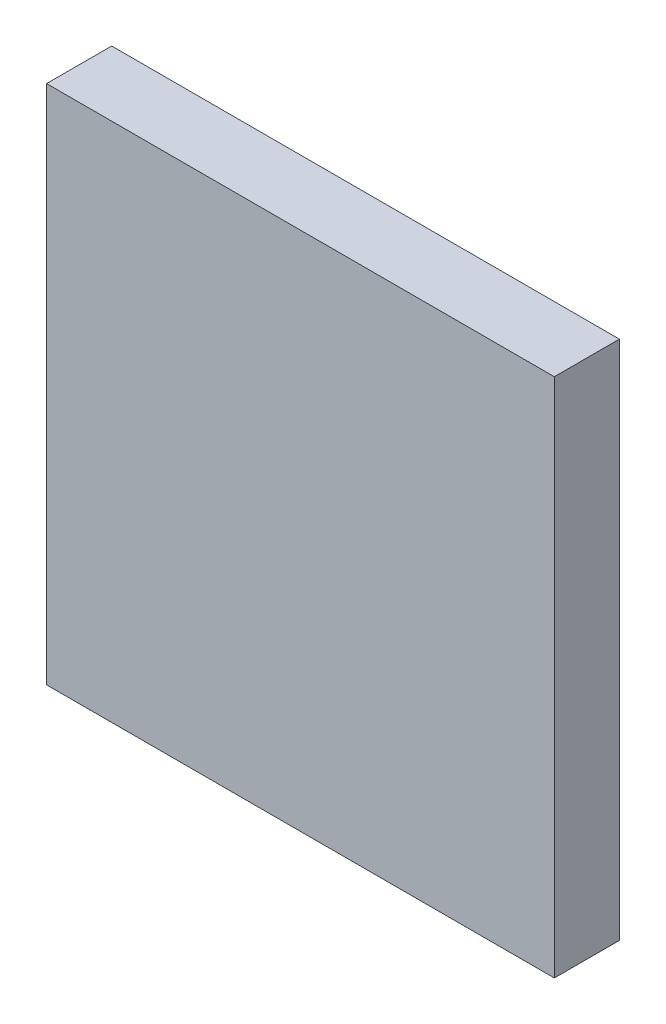
ISO-10303-21;
HEADER;
FILE_DESCRIPTION(('STEP AP214'),'2;1');
FILE_NAME('part.step','',(''),(''),'','','');
FILE_SCHEMA(('AUTOMOTIVE_DESIGN { 1 0 10303 214 1 1 1 1 }'));
ENDSEC;
DATA;
#1=APPLICATION_CONTEXT('core data for automotive mechanical design processes');
#2=APPLICATION_PROTOCOL_DEFINITION('international standard','automotive_design',2000,#1);
#3=PRODUCT_CONTEXT('',#1,'mechanical');
#4=PRODUCT('Part','Part','',(#3));
#5=PRODUCT_RELATED_PRODUCT_CATEGORY('part','',(#4));
#6=PRODUCT_DEFINITION_FORMATION('','',#4);
#7=PRODUCT_DEFINITION_CONTEXT('part definition',#1,'design');
#8=PRODUCT_DEFINITION('design','',#6,#7);
#9=PRODUCT_DEFINITION_SHAPE('','',#8);
#10=(LENGTH_UNIT() NAMED_UNIT(*) SI_UNIT(.MILLI.,.METRE.));
#11=(NAMED_UNIT(*) PLANE_ANGLE_UNIT() SI_UNIT($,.RADIAN.));
#12=(NAMED_UNIT(*) SI_UNIT($,.STERADIAN.) SOLID_ANGLE_UNIT());
#13=UNCERTAINTY_MEASURE_WITH_UNIT(LENGTH_MEASURE(1.E-05),#10,'distance_accuracy_value','');
#14=(GEOMETRIC_REPRESENTATION_CONTEXT(3) GLOBAL_UNCERTAINTY_ASSIGNED_CONTEXT((#13)) GLOBAL_UNIT_ASSIGNED_CONTEXT((#10,
#11,#12)) REPRESENTATION_CONTEXT('',''));
#15=CARTESIAN_POINT('',(0.,0.,0.));
#16=DIRECTION('',(0.,0.,1.));
#17=DIRECTION('',(1.,0.,0.));
#18=AXIS2_PLACEMENT_3D('',#15,#16,#17);
#19=CARTESIAN_POINT('',(0.,0.,-50.));
#20=DIRECTION('',(-1.,0.,0.));
#21=DIRECTION('',(0.,0.,1.));
#22=AXIS2_PLACEMENT_3D('',#19,#20,#21);
#23=PLANE('',#22);
#24=DIRECTION('',(0.,-1.,0.));
#25=VECTOR('',#24,1.);
#26=CARTESIAN_POINT('',(0.,0.,0.));
#27=LINE('',#26,#25);
#28=CARTESIAN_POINT('',(0.,0.,0.));
#29=VERTEX_POINT('',#28);
#30=CARTESIAN_POINT('',(0.,-400.,0.));
#31=VERTEX_POINT('',#30);
#32=EDGE_CURVE('E103',#29,#31,#27,.T.);
#33=ORIENTED_EDGE('',*,*,#32,.F.);
#34=DIRECTION('',(0.,0.,1.));
#35=VECTOR('',#34,1.);
#36=CARTESIAN_POINT('',(0.,0.,-50.));
#37=LINE('',#36,#35);
#38=CARTESIAN_POINT('',(0.,0.,-50.));
#39=VERTEX_POINT('',#38);
#40=EDGE_CURVE('E11',#39,#29,#37,.T.);
#41=ORIENTED_EDGE('',*,*,#40,.F.);
#42=DIRECTION('',(0.,-1.,0.));
#43=VECTOR('',#42,1.);
#44=CARTESIAN_POINT('',(0.,0.,-50.));
#45=LINE('',#44,#43);
#46=CARTESIAN_POINT('',(0.,-400.,-50.));
#47=VERTEX_POINT('',#46);
#48=EDGE_CURVE('E97',#39,#47,#45,.T.);
#49=ORIENTED_EDGE('',*,*,#48,.T.);
#50=DIRECTION('',(0.,0.,1.));
#51=VECTOR('',#50,1.);
#52=CARTESIAN_POINT('',(0.,-400.,-50.));
#53=LINE('',#52,#51);
#54=EDGE_CURVE('E42',#47,#31,#53,.T.);
#55=ORIENTED_EDGE('',*,*,#54,.T.);
#56=EDGE_LOOP('',(#33,#41,#49,#55));
#57=FACE_BOUND('',#56,.T.);
#58=ADVANCED_FACE('F39',(#57),#23,.T.);
#59=CARTESIAN_POINT('',(0.,0.,-50.));
#60=DIRECTION('',(0.,1.,0.));
#61=DIRECTION('',(0.,0.,1.));
#62=AXIS2_PLACEMENT_3D('',#59,#60,#61);
#63=PLANE('',#62);
#64=DIRECTION('',(-1.,0.,0.));
#65=VECTOR('',#64,1.);
#66=CARTESIAN_POINT('',(0.,0.,0.));
#67=LINE('',#66,#65);
#68=CARTESIAN_POINT('',(390.,0.,0.));
#69=VERTEX_POINT('',#68);
#70=EDGE_CURVE('E99',#69,#29,#67,.T.);
#71=ORIENTED_EDGE('',*,*,#70,.F.);
#72=DIRECTION('',(0.,0.,1.));
#73=VECTOR('',#72,1.);
#74=CARTESIAN_POINT('',(390.,0.,-50.));
#75=LINE('',#74,#73);
#76=CARTESIAN_POINT('',(390.,0.,-50.));
#77=VERTEX_POINT('',#76);
#78=EDGE_CURVE('E48',#77,#69,#75,.T.);
#79=ORIENTED_EDGE('',*,*,#78,.F.);
#80=DIRECTION('',(-1.,0.,0.));
#81=VECTOR('',#80,1.);
#82=CARTESIAN_POINT('',(0.,0.,-50.));
#83=LINE('',#82,#81);
#84=EDGE_CURVE('E94',#77,#39,#83,.T.);
#85=ORIENTED_EDGE('',*,*,#84,.T.);
#86=ORIENTED_EDGE('',*,*,#40,.T.);
#87=EDGE_LOOP('',(#71,#79,#85,#86));
#88=FACE_BOUND('',#87,.T.);
#89=ADVANCED_FACE('F113',(#88),#63,.T.);
#90=CARTESIAN_POINT('',(390.,0.,-50.));
#91=DIRECTION('',(1.,0.,0.));
#92=DIRECTION('',(0.,0.,-1.));
#93=AXIS2_PLACEMENT_3D('',#90,#91,#92);
#94=PLANE('',#93);
#95=DIRECTION('',(0.,1.,0.));
#96=VECTOR('',#95,1.);
#97=CARTESIAN_POINT('',(390.,0.,0.));
#98=LINE('',#97,#96);
#99=CARTESIAN_POINT('',(390.,-400.,0.));
#100=VERTEX_POINT('',#99);
#101=EDGE_CURVE('E89',#100,#69,#98,.T.);
#102=ORIENTED_EDGE('',*,*,#101,.F.);
#103=DIRECTION('',(0.,0.,1.));
#104=VECTOR('',#103,1.);
#105=CARTESIAN_POINT('',(390.,-400.,-50.));
#106=LINE('',#105,#104);
#107=CARTESIAN_POINT('',(390.,-400.,-50.));
#108=VERTEX_POINT('',#107);
#109=EDGE_CURVE('E84',#108,#100,#106,.T.);
#110=ORIENTED_EDGE('',*,*,#109,.F.);
#111=DIRECTION('',(0.,1.,0.));
#112=VECTOR('',#111,1.);
#113=CARTESIAN_POINT('',(390.,0.,-50.));
#114=LINE('',#113,#112);
#115=EDGE_CURVE('E87',#108,#77,#114,.T.);
#116=ORIENTED_EDGE('',*,*,#115,.T.);
#117=ORIENTED_EDGE('',*,*,#78,.T.);
#118=EDGE_LOOP('',(#102,#110,#116,#117));
#119=FACE_BOUND('',#118,.T.);
#120=ADVANCED_FACE('F86',(#119),#94,.T.);
#121=CARTESIAN_POINT('',(0.,-400.,-50.));
#122=DIRECTION('',(0.,-1.,0.));
#123=DIRECTION('',(0.,0.,-1.));
#124=AXIS2_PLACEMENT_3D('',#121,#122,#123);
#125=PLANE('',#124);
#126=DIRECTION('',(1.,0.,0.));
#127=VECTOR('',#126,1.);
#128=CARTESIAN_POINT('',(0.,-400.,0.));
#129=LINE('',#128,#127);
#130=EDGE_CURVE('E106',#31,#100,#129,.T.);
#131=ORIENTED_EDGE('',*,*,#130,.F.);
#132=ORIENTED_EDGE('',*,*,#54,.F.);
#133=DIRECTION('',(1.,0.,0.));
#134=VECTOR('',#133,1.);
#135=CARTESIAN_POINT('',(0.,-400.,-50.));
#136=LINE('',#135,#134);
#137=EDGE_CURVE('E93',#47,#108,#136,.T.);
#138=ORIENTED_EDGE('',*,*,#137,.T.);
#139=ORIENTED_EDGE('',*,*,#109,.T.);
#140=EDGE_LOOP('',(#131,#132,#138,#139));
#141=FACE_BOUND('',#140,.T.);
#142=ADVANCED_FACE('F96',(#141),#125,.T.);
#143=CARTESIAN_POINT('',(0.,0.,-50.));
#144=DIRECTION('',(0.,0.,1.));
#145=DIRECTION('',(1.,0.,0.));
#146=AXIS2_PLACEMENT_3D('',#143,#144,#145);
#147=PLANE('',#146);
#148=ORIENTED_EDGE('',*,*,#48,.F.);
#149=ORIENTED_EDGE('',*,*,#84,.F.);
#150=ORIENTED_EDGE('',*,*,#115,.F.);
#151=ORIENTED_EDGE('',*,*,#137,.F.);
#152=EDGE_LOOP('',(#148,#149,#150,#151));
#153=FACE_BOUND('',#152,.T.);
#154=ADVANCED_FACE('F92',(#153),#147,.F.);
#155=CARTESIAN_POINT('',(0.,0.,0.));
#156=DIRECTION('',(0.,0.,1.));
#157=DIRECTION('',(1.,0.,0.));
#158=AXIS2_PLACEMENT_3D('',#155,#156,#157);
#159=PLANE('',#158);
#160=ORIENTED_EDGE('',*,*,#32,.T.);
#161=ORIENTED_EDGE('',*,*,#130,.T.);
#162=ORIENTED_EDGE('',*,*,#101,.T.);
#163=ORIENTED_EDGE('',*,*,#70,.T.);
#164=EDGE_LOOP('',(#160,#161,#162,#163));
#165=FACE_BOUND('',#164,.T.);
#166=ADVANCED_FACE('F112',(#165),#159,.T.);
#167=CLOSED_SHELL('',(#58,#89,#120,#142,#154,#166));
#168=MANIFOLD_SOLID_BREP('B2',#167);
#169=ADVANCED_BREP_SHAPE_REPRESENTATION('',(#18,#168),#14);
#170=SHAPE_DEFINITION_REPRESENTATION(#9,#169);
ENDSEC;
END-ISO-10303-21;
